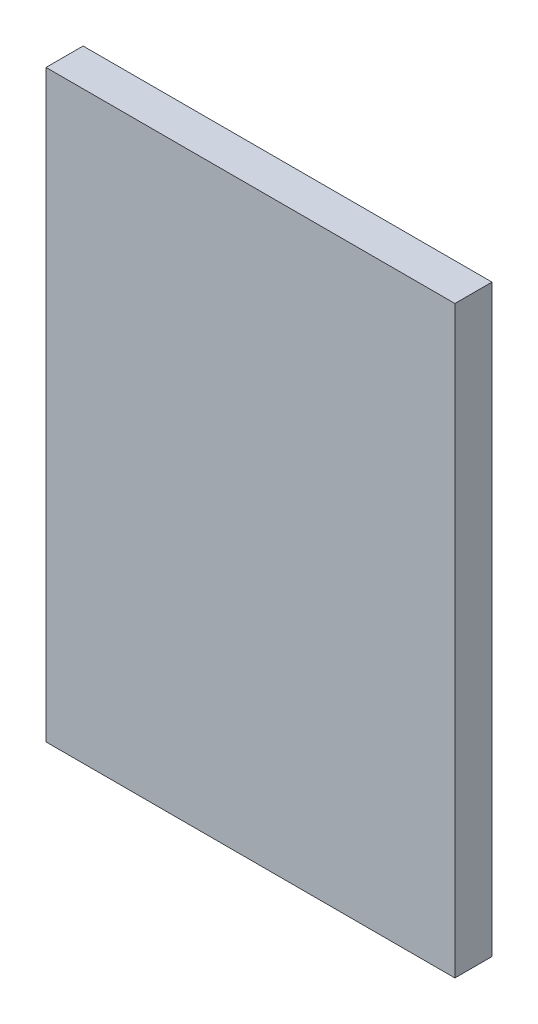
ISO-10303-21;
HEADER;
FILE_DESCRIPTION(('STEP AP214'),'2;1');
FILE_NAME('part.step','',(''),(''),'','','');
FILE_SCHEMA(('AUTOMOTIVE_DESIGN { 1 0 10303 214 1 1 1 1 }'));
ENDSEC;
DATA;
#1=APPLICATION_CONTEXT('core data for automotive mechanical design processes');
#2=APPLICATION_PROTOCOL_DEFINITION('international standard','automotive_design',2000,#1);
#3=PRODUCT_CONTEXT('',#1,'mechanical');
#4=PRODUCT('Part','Part','',(#3));
#5=PRODUCT_RELATED_PRODUCT_CATEGORY('part','',(#4));
#6=PRODUCT_DEFINITION_FORMATION('','',#4);
#7=PRODUCT_DEFINITION_CONTEXT('part definition',#1,'design');
#8=PRODUCT_DEFINITION('design','',#6,#7);
#9=PRODUCT_DEFINITION_SHAPE('','',#8);
#10=(LENGTH_UNIT() NAMED_UNIT(*) SI_UNIT(.MILLI.,.METRE.));
#11=(NAMED_UNIT(*) PLANE_ANGLE_UNIT() SI_UNIT($,.RADIAN.));
#12=(NAMED_UNIT(*) SI_UNIT($,.STERADIAN.) SOLID_ANGLE_UNIT());
#13=UNCERTAINTY_MEASURE_WITH_UNIT(LENGTH_MEASURE(1.E-05),#10,'distance_accuracy_value','');
#14=(GEOMETRIC_REPRESENTATION_CONTEXT(3) GLOBAL_UNCERTAINTY_ASSIGNED_CONTEXT((#13)) GLOBAL_UNIT_ASSIGNED_CONTEXT((#10,
#11,#12)) REPRESENTATION_CONTEXT('',''));
#15=CARTESIAN_POINT('',(0.,0.,0.));
#16=DIRECTION('',(0.,0.,1.));
#17=DIRECTION('',(1.,0.,0.));
#18=AXIS2_PLACEMENT_3D('',#15,#16,#17);
#19=CARTESIAN_POINT('',(17.5,-25.,3.175));
#20=DIRECTION('',(-1.,0.,0.));
#21=DIRECTION('',(0.,0.,1.));
#22=AXIS2_PLACEMENT_3D('',#19,#20,#21);
#23=PLANE('',#22);
#24=DIRECTION('',(0.,1.,0.));
#25=VECTOR('',#24,1.);
#26=CARTESIAN_POINT('',(17.5,-25.,0.));
#27=LINE('',#26,#25);
#28=CARTESIAN_POINT('',(17.5,-25.,0.));
#29=VERTEX_POINT('',#28);
#30=CARTESIAN_POINT('',(17.5,25.,0.));
#31=VERTEX_POINT('',#30);
#32=EDGE_CURVE('E96',#29,#31,#27,.T.);
#33=ORIENTED_EDGE('',*,*,#32,.T.);
#34=DIRECTION('',(0.,0.,-1.));
#35=VECTOR('',#34,1.);
#36=CARTESIAN_POINT('',(17.5,25.,3.175));
#37=LINE('',#36,#35);
#38=CARTESIAN_POINT('',(17.5,25.,3.175));
#39=VERTEX_POINT('',#38);
#40=EDGE_CURVE('E11',#39,#31,#37,.T.);
#41=ORIENTED_EDGE('',*,*,#40,.F.);
#42=DIRECTION('',(0.,1.,0.));
#43=VECTOR('',#42,1.);
#44=CARTESIAN_POINT('',(17.5,-25.,3.175));
#45=LINE('',#44,#43);
#46=CARTESIAN_POINT('',(17.5,-25.,3.175));
#47=VERTEX_POINT('',#46);
#48=EDGE_CURVE('E84',#47,#39,#45,.T.);
#49=ORIENTED_EDGE('',*,*,#48,.F.);
#50=DIRECTION('',(0.,0.,-1.));
#51=VECTOR('',#50,1.);
#52=CARTESIAN_POINT('',(17.5,-25.,3.175));
#53=LINE('',#52,#51);
#54=EDGE_CURVE('E92',#47,#29,#53,.T.);
#55=ORIENTED_EDGE('',*,*,#54,.T.);
#56=EDGE_LOOP('',(#33,#41,#49,#55));
#57=FACE_BOUND('',#56,.T.);
#58=ADVANCED_FACE('F33',(#57),#23,.F.);
#59=CARTESIAN_POINT('',(-17.5,25.,3.175));
#60=DIRECTION('',(0.,-1.,0.));
#61=DIRECTION('',(0.,0.,-1.));
#62=AXIS2_PLACEMENT_3D('',#59,#60,#61);
#63=PLANE('',#62);
#64=DIRECTION('',(-1.,0.,0.));
#65=VECTOR('',#64,1.);
#66=CARTESIAN_POINT('',(-17.5,25.,0.));
#67=LINE('',#66,#65);
#68=CARTESIAN_POINT('',(-17.5,25.,0.));
#69=VERTEX_POINT('',#68);
#70=EDGE_CURVE('E88',#31,#69,#67,.T.);
#71=ORIENTED_EDGE('',*,*,#70,.T.);
#72=DIRECTION('',(0.,0.,-1.));
#73=VECTOR('',#72,1.);
#74=CARTESIAN_POINT('',(-17.5,25.,3.175));
#75=LINE('',#74,#73);
#76=CARTESIAN_POINT('',(-17.5,25.,3.175));
#77=VERTEX_POINT('',#76);
#78=EDGE_CURVE('E41',#77,#69,#75,.T.);
#79=ORIENTED_EDGE('',*,*,#78,.F.);
#80=DIRECTION('',(-1.,0.,0.));
#81=VECTOR('',#80,1.);
#82=CARTESIAN_POINT('',(-17.5,25.,3.175));
#83=LINE('',#82,#81);
#84=EDGE_CURVE('E79',#39,#77,#83,.T.);
#85=ORIENTED_EDGE('',*,*,#84,.F.);
#86=ORIENTED_EDGE('',*,*,#40,.T.);
#87=EDGE_LOOP('',(#71,#79,#85,#86));
#88=FACE_BOUND('',#87,.T.);
#89=ADVANCED_FACE('F87',(#88),#63,.F.);
#90=CARTESIAN_POINT('',(-17.5,-25.,3.175));
#91=DIRECTION('',(1.,0.,0.));
#92=DIRECTION('',(0.,0.,-1.));
#93=AXIS2_PLACEMENT_3D('',#90,#91,#92);
#94=PLANE('',#93);
#95=DIRECTION('',(0.,-1.,0.));
#96=VECTOR('',#95,1.);
#97=CARTESIAN_POINT('',(-17.5,-25.,0.));
#98=LINE('',#97,#96);
#99=CARTESIAN_POINT('',(-17.5,-25.,0.));
#100=VERTEX_POINT('',#99);
#101=EDGE_CURVE('E66',#69,#100,#98,.T.);
#102=ORIENTED_EDGE('',*,*,#101,.T.);
#103=DIRECTION('',(0.,0.,-1.));
#104=VECTOR('',#103,1.);
#105=CARTESIAN_POINT('',(-17.5,-25.,3.175));
#106=LINE('',#105,#104);
#107=CARTESIAN_POINT('',(-17.5,-25.,3.175));
#108=VERTEX_POINT('',#107);
#109=EDGE_CURVE('E89',#108,#100,#106,.T.);
#110=ORIENTED_EDGE('',*,*,#109,.F.);
#111=DIRECTION('',(0.,-1.,0.));
#112=VECTOR('',#111,1.);
#113=CARTESIAN_POINT('',(-17.5,-25.,3.175));
#114=LINE('',#113,#112);
#115=EDGE_CURVE('E82',#77,#108,#114,.T.);
#116=ORIENTED_EDGE('',*,*,#115,.F.);
#117=ORIENTED_EDGE('',*,*,#78,.T.);
#118=EDGE_LOOP('',(#102,#110,#116,#117));
#119=FACE_BOUND('',#118,.T.);
#120=ADVANCED_FACE('F90',(#119),#94,.F.);
#121=CARTESIAN_POINT('',(-17.5,-25.,3.175));
#122=DIRECTION('',(0.,1.,0.));
#123=DIRECTION('',(0.,0.,1.));
#124=AXIS2_PLACEMENT_3D('',#121,#122,#123);
#125=PLANE('',#124);
#126=DIRECTION('',(1.,0.,0.));
#127=VECTOR('',#126,1.);
#128=CARTESIAN_POINT('',(-17.5,-25.,0.));
#129=LINE('',#128,#127);
#130=EDGE_CURVE('E72',#100,#29,#129,.T.);
#131=ORIENTED_EDGE('',*,*,#130,.T.);
#132=ORIENTED_EDGE('',*,*,#54,.F.);
#133=DIRECTION('',(1.,0.,0.));
#134=VECTOR('',#133,1.);
#135=CARTESIAN_POINT('',(-17.5,-25.,3.175));
#136=LINE('',#135,#134);
#137=EDGE_CURVE('E49',#108,#47,#136,.T.);
#138=ORIENTED_EDGE('',*,*,#137,.F.);
#139=ORIENTED_EDGE('',*,*,#109,.T.);
#140=EDGE_LOOP('',(#131,#132,#138,#139));
#141=FACE_BOUND('',#140,.T.);
#142=ADVANCED_FACE('F103',(#141),#125,.F.);
#143=CARTESIAN_POINT('',(0.,0.,3.175));
#144=DIRECTION('',(0.,0.,-1.));
#145=DIRECTION('',(-1.,0.,0.));
#146=AXIS2_PLACEMENT_3D('',#143,#144,#145);
#147=PLANE('',#146);
#148=ORIENTED_EDGE('',*,*,#48,.T.);
#149=ORIENTED_EDGE('',*,*,#84,.T.);
#150=ORIENTED_EDGE('',*,*,#115,.T.);
#151=ORIENTED_EDGE('',*,*,#137,.T.);
#152=EDGE_LOOP('',(#148,#149,#150,#151));
#153=FACE_BOUND('',#152,.T.);
#154=ADVANCED_FACE('F80',(#153),#147,.F.);
#155=CARTESIAN_POINT('',(0.,0.,0.));
#156=DIRECTION('',(0.,0.,-1.));
#157=DIRECTION('',(-1.,0.,0.));
#158=AXIS2_PLACEMENT_3D('',#155,#156,#157);
#159=PLANE('',#158);
#160=ORIENTED_EDGE('',*,*,#32,.F.);
#161=ORIENTED_EDGE('',*,*,#130,.F.);
#162=ORIENTED_EDGE('',*,*,#101,.F.);
#163=ORIENTED_EDGE('',*,*,#70,.F.);
#164=EDGE_LOOP('',(#160,#161,#162,#163));
#165=FACE_BOUND('',#164,.T.);
#166=ADVANCED_FACE('F106',(#165),#159,.T.);
#167=CLOSED_SHELL('',(#58,#89,#120,#142,#154,#166));
#168=MANIFOLD_SOLID_BREP('B2',#167);
#169=ADVANCED_BREP_SHAPE_REPRESENTATION('',(#18,#168),#14);
#170=SHAPE_DEFINITION_REPRESENTATION(#9,#169);
ENDSEC;
END-ISO-10303-21;
